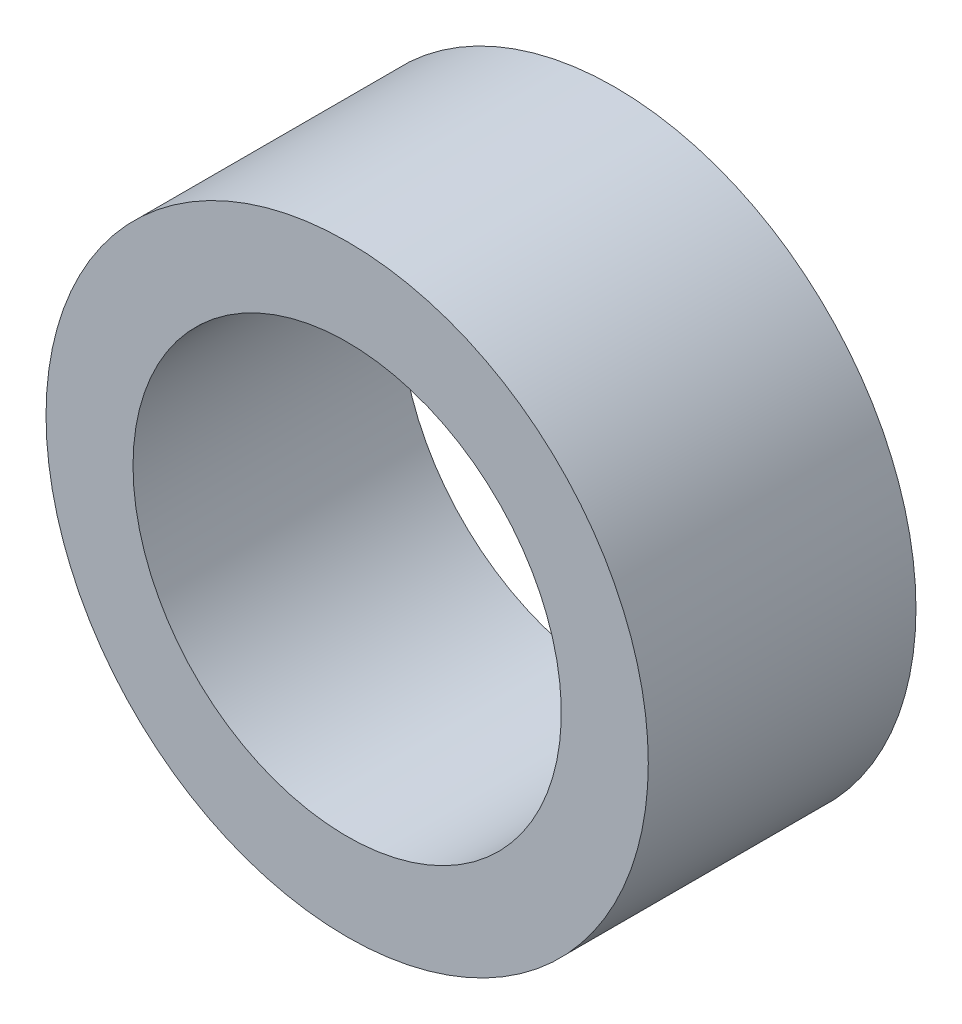
ISO-10303-21;
HEADER;
FILE_DESCRIPTION(('STEP AP214'),'2;1');
FILE_NAME('part.step','',(''),(''),'','','');
FILE_SCHEMA(('AUTOMOTIVE_DESIGN { 1 0 10303 214 1 1 1 1 }'));
ENDSEC;
DATA;
#1=APPLICATION_CONTEXT('core data for automotive mechanical design processes');
#2=APPLICATION_PROTOCOL_DEFINITION('international standard','automotive_design',2000,#1);
#3=PRODUCT_CONTEXT('',#1,'mechanical');
#4=PRODUCT('Part','Part','',(#3));
#5=PRODUCT_RELATED_PRODUCT_CATEGORY('part','',(#4));
#6=PRODUCT_DEFINITION_FORMATION('','',#4);
#7=PRODUCT_DEFINITION_CONTEXT('part definition',#1,'design');
#8=PRODUCT_DEFINITION('design','',#6,#7);
#9=PRODUCT_DEFINITION_SHAPE('','',#8);
#10=(LENGTH_UNIT() NAMED_UNIT(*) SI_UNIT(.MILLI.,.METRE.));
#11=(NAMED_UNIT(*) PLANE_ANGLE_UNIT() SI_UNIT($,.RADIAN.));
#12=(NAMED_UNIT(*) SI_UNIT($,.STERADIAN.) SOLID_ANGLE_UNIT());
#13=UNCERTAINTY_MEASURE_WITH_UNIT(LENGTH_MEASURE(1.E-05),#10,'distance_accuracy_value','');
#14=(GEOMETRIC_REPRESENTATION_CONTEXT(3) GLOBAL_UNCERTAINTY_ASSIGNED_CONTEXT((#13)) GLOBAL_UNIT_ASSIGNED_CONTEXT((#10,
#11,#12)) REPRESENTATION_CONTEXT('',''));
#15=CARTESIAN_POINT('',(0.,0.,0.));
#16=DIRECTION('',(0.,0.,1.));
#17=DIRECTION('',(1.,0.,0.));
#18=AXIS2_PLACEMENT_3D('',#15,#16,#17);
#19=CARTESIAN_POINT('',(0.,0.,1.));
#20=DIRECTION('',(0.,0.,-1.));
#21=DIRECTION('',(-1.,0.,0.));
#22=AXIS2_PLACEMENT_3D('',#19,#20,#21);
#23=CYLINDRICAL_SURFACE('',#22,2.25);
#24=CARTESIAN_POINT('',(0.,0.,1.));
#25=DIRECTION('',(0.,0.,-1.));
#26=DIRECTION('',(-1.,0.,0.));
#27=AXIS2_PLACEMENT_3D('',#24,#25,#26);
#28=CIRCLE('',#27,2.25);
#29=CARTESIAN_POINT('',(-2.25,0.,1.));
#30=VERTEX_POINT('',#29);
#31=EDGE_CURVE('E18',#30,#30,#28,.F.);
#32=ORIENTED_EDGE('',*,*,#31,.F.);
#33=EDGE_LOOP('',(#32));
#34=FACE_BOUND('',#33,.T.);
#35=CARTESIAN_POINT('',(0.,0.,-1.));
#36=DIRECTION('',(0.,0.,-1.));
#37=DIRECTION('',(-1.,0.,0.));
#38=AXIS2_PLACEMENT_3D('',#35,#36,#37);
#39=CIRCLE('',#38,2.25);
#40=CARTESIAN_POINT('',(-2.25,0.,-1.));
#41=VERTEX_POINT('',#40);
#42=EDGE_CURVE('E27',#41,#41,#39,.F.);
#43=ORIENTED_EDGE('',*,*,#42,.T.);
#44=EDGE_LOOP('',(#43));
#45=FACE_BOUND('',#44,.T.);
#46=ADVANCED_FACE('F14',(#34,#45),#23,.T.);
#47=CARTESIAN_POINT('',(-2.277,-2.277,1.));
#48=DIRECTION('',(0.,0.,1.));
#49=DIRECTION('',(1.,0.,0.));
#50=AXIS2_PLACEMENT_3D('',#47,#48,#49);
#51=PLANE('',#50);
#52=CARTESIAN_POINT('',(0.,0.,1.));
#53=DIRECTION('',(0.,0.,-1.));
#54=DIRECTION('',(-1.,0.,0.));
#55=AXIS2_PLACEMENT_3D('',#52,#53,#54);
#56=CIRCLE('',#55,1.6);
#57=CARTESIAN_POINT('',(-1.6,0.,1.));
#58=VERTEX_POINT('',#57);
#59=EDGE_CURVE('E22',#58,#58,#56,.F.);
#60=ORIENTED_EDGE('',*,*,#59,.F.);
#61=EDGE_LOOP('',(#60));
#62=FACE_BOUND('',#61,.T.);
#63=ORIENTED_EDGE('',*,*,#31,.T.);
#64=EDGE_LOOP('',(#63));
#65=FACE_BOUND('',#64,.T.);
#66=ADVANCED_FACE('F35',(#62,#65),#51,.T.);
#67=CARTESIAN_POINT('',(-2.277,-2.277,-1.));
#68=DIRECTION('',(0.,0.,1.));
#69=DIRECTION('',(1.,0.,0.));
#70=AXIS2_PLACEMENT_3D('',#67,#68,#69);
#71=PLANE('',#70);
#72=CARTESIAN_POINT('',(0.,0.,-1.));
#73=DIRECTION('',(0.,0.,-1.));
#74=DIRECTION('',(-1.,0.,0.));
#75=AXIS2_PLACEMENT_3D('',#72,#73,#74);
#76=CIRCLE('',#75,1.6);
#77=CARTESIAN_POINT('',(-1.6,0.,-1.));
#78=VERTEX_POINT('',#77);
#79=EDGE_CURVE('E9',#78,#78,#76,.T.);
#80=ORIENTED_EDGE('',*,*,#79,.F.);
#81=EDGE_LOOP('',(#80));
#82=FACE_BOUND('',#81,.T.);
#83=ORIENTED_EDGE('',*,*,#42,.F.);
#84=EDGE_LOOP('',(#83));
#85=FACE_BOUND('',#84,.T.);
#86=ADVANCED_FACE('F16',(#82,#85),#71,.F.);
#87=CARTESIAN_POINT('',(0.,0.,1.));
#88=DIRECTION('',(0.,0.,-1.));
#89=DIRECTION('',(-1.,0.,0.));
#90=AXIS2_PLACEMENT_3D('',#87,#88,#89);
#91=CYLINDRICAL_SURFACE('',#90,1.6);
#92=ORIENTED_EDGE('',*,*,#79,.T.);
#93=EDGE_LOOP('',(#92));
#94=FACE_BOUND('',#93,.T.);
#95=ORIENTED_EDGE('',*,*,#59,.T.);
#96=EDGE_LOOP('',(#95));
#97=FACE_BOUND('',#96,.T.);
#98=ADVANCED_FACE('F45',(#94,#97),#91,.F.);
#99=CLOSED_SHELL('',(#46,#66,#86,#98));
#100=MANIFOLD_SOLID_BREP('B1',#99);
#101=ADVANCED_BREP_SHAPE_REPRESENTATION('',(#18,#100),#14);
#102=SHAPE_DEFINITION_REPRESENTATION(#9,#101);
ENDSEC;
END-ISO-10303-21;
